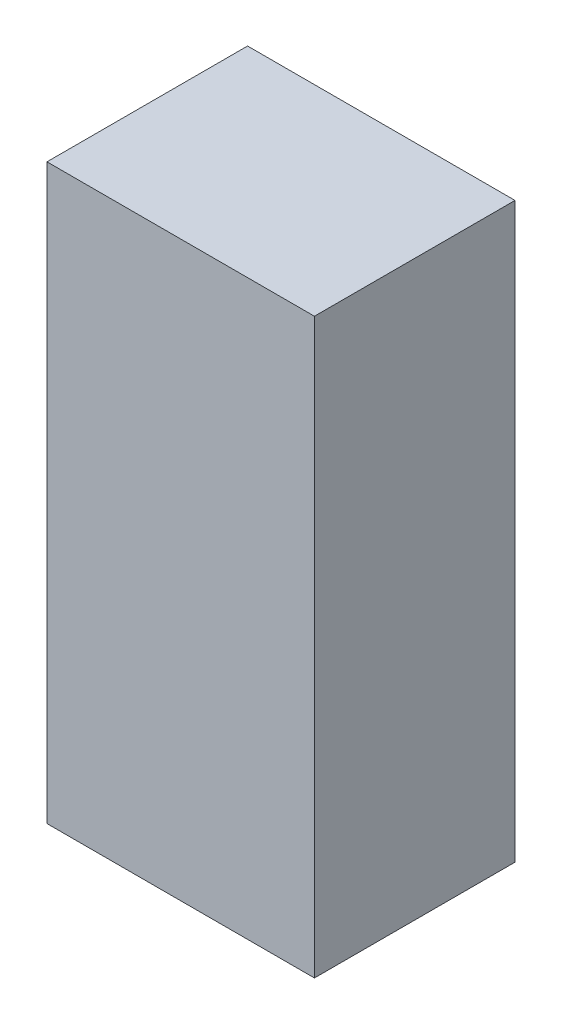
ISO-10303-21;
HEADER;
FILE_DESCRIPTION(('STEP AP214'),'2;1');
FILE_NAME('part.step','',(''),(''),'','','');
FILE_SCHEMA(('AUTOMOTIVE_DESIGN { 1 0 10303 214 1 1 1 1 }'));
ENDSEC;
DATA;
#1=APPLICATION_CONTEXT('core data for automotive mechanical design processes');
#2=APPLICATION_PROTOCOL_DEFINITION('international standard','automotive_design',2000,#1);
#3=PRODUCT_CONTEXT('',#1,'mechanical');
#4=PRODUCT('Part','Part','',(#3));
#5=PRODUCT_RELATED_PRODUCT_CATEGORY('part','',(#4));
#6=PRODUCT_DEFINITION_FORMATION('','',#4);
#7=PRODUCT_DEFINITION_CONTEXT('part definition',#1,'design');
#8=PRODUCT_DEFINITION('design','',#6,#7);
#9=PRODUCT_DEFINITION_SHAPE('','',#8);
#10=(LENGTH_UNIT() NAMED_UNIT(*) SI_UNIT(.MILLI.,.METRE.));
#11=(NAMED_UNIT(*) PLANE_ANGLE_UNIT() SI_UNIT($,.RADIAN.));
#12=(NAMED_UNIT(*) SI_UNIT($,.STERADIAN.) SOLID_ANGLE_UNIT());
#13=UNCERTAINTY_MEASURE_WITH_UNIT(LENGTH_MEASURE(1.E-05),#10,'distance_accuracy_value','');
#14=(GEOMETRIC_REPRESENTATION_CONTEXT(3) GLOBAL_UNCERTAINTY_ASSIGNED_CONTEXT((#13)) GLOBAL_UNIT_ASSIGNED_CONTEXT((#10,
#11,#12)) REPRESENTATION_CONTEXT('',''));
#15=CARTESIAN_POINT('',(0.,0.,0.));
#16=DIRECTION('',(0.,0.,1.));
#17=DIRECTION('',(1.,0.,0.));
#18=AXIS2_PLACEMENT_3D('',#15,#16,#17);
#19=CARTESIAN_POINT('',(-0.6999986,1.49999954,1.05000044));
#20=DIRECTION('',(0.,0.,-1.));
#21=DIRECTION('',(-1.,0.,0.));
#22=AXIS2_PLACEMENT_3D('',#19,#20,#21);
#23=PLANE('',#22);
#24=DIRECTION('',(1.,0.,0.));
#25=VECTOR('',#24,1.);
#26=CARTESIAN_POINT('',(-0.6999986,-1.49999954,1.05000044));
#27=LINE('',#26,#25);
#28=CARTESIAN_POINT('',(-0.6999986,-1.49999954,1.05000044));
#29=VERTEX_POINT('',#28);
#30=CARTESIAN_POINT('',(0.70000114,-1.49999954,1.05000044));
#31=VERTEX_POINT('',#30);
#32=EDGE_CURVE('E55',#29,#31,#27,.T.);
#33=ORIENTED_EDGE('',*,*,#32,.T.);
#34=DIRECTION('',(0.,1.,0.));
#35=VECTOR('',#34,1.);
#36=CARTESIAN_POINT('',(0.70000114,-1.49999954,1.05000044));
#37=LINE('',#36,#35);
#38=CARTESIAN_POINT('',(0.70000114,1.49999954,1.05000044));
#39=VERTEX_POINT('',#38);
#40=EDGE_CURVE('E57',#31,#39,#37,.T.);
#41=ORIENTED_EDGE('',*,*,#40,.T.);
#42=DIRECTION('',(1.,0.,0.));
#43=VECTOR('',#42,1.);
#44=CARTESIAN_POINT('',(0.70000114,1.49999954,1.05000044));
#45=LINE('',#44,#43);
#46=CARTESIAN_POINT('',(-0.6999986,1.49999954,1.05000044));
#47=VERTEX_POINT('',#46);
#48=EDGE_CURVE('E20',#39,#47,#45,.F.);
#49=ORIENTED_EDGE('',*,*,#48,.T.);
#50=DIRECTION('',(0.,1.,0.));
#51=VECTOR('',#50,1.);
#52=CARTESIAN_POINT('',(-0.6999986,1.49999954,1.05000044));
#53=LINE('',#52,#51);
#54=EDGE_CURVE('E80',#47,#29,#53,.F.);
#55=ORIENTED_EDGE('',*,*,#54,.T.);
#56=EDGE_LOOP('',(#33,#41,#49,#55));
#57=FACE_BOUND('',#56,.T.);
#58=ADVANCED_FACE('F17',(#57),#23,.F.);
#59=CARTESIAN_POINT('',(0.70000114,1.49999954,0.));
#60=DIRECTION('',(0.,-1.,0.));
#61=DIRECTION('',(0.,0.,-1.));
#62=AXIS2_PLACEMENT_3D('',#59,#60,#61);
#63=PLANE('',#62);
#64=DIRECTION('',(0.,0.,-1.));
#65=VECTOR('',#64,1.);
#66=CARTESIAN_POINT('',(-0.6999986,1.49999954,0.));
#67=LINE('',#66,#65);
#68=CARTESIAN_POINT('',(-0.6999986,1.49999954,0.));
#69=VERTEX_POINT('',#68);
#70=EDGE_CURVE('E68',#69,#47,#67,.F.);
#71=ORIENTED_EDGE('',*,*,#70,.T.);
#72=ORIENTED_EDGE('',*,*,#48,.F.);
#73=DIRECTION('',(0.,0.,1.));
#74=VECTOR('',#73,1.);
#75=CARTESIAN_POINT('',(0.70000114,1.49999954,0.));
#76=LINE('',#75,#74);
#77=CARTESIAN_POINT('',(0.70000114,1.49999954,0.));
#78=VERTEX_POINT('',#77);
#79=EDGE_CURVE('E63',#39,#78,#76,.F.);
#80=ORIENTED_EDGE('',*,*,#79,.T.);
#81=DIRECTION('',(-1.,0.,0.));
#82=VECTOR('',#81,1.);
#83=CARTESIAN_POINT('',(-0.6999986,1.49999954,0.));
#84=LINE('',#83,#82);
#85=EDGE_CURVE('E83',#69,#78,#84,.F.);
#86=ORIENTED_EDGE('',*,*,#85,.F.);
#87=EDGE_LOOP('',(#71,#72,#80,#86));
#88=FACE_BOUND('',#87,.T.);
#89=ADVANCED_FACE('F65',(#88),#63,.F.);
#90=CARTESIAN_POINT('',(0.70000114,-1.49999954,0.));
#91=DIRECTION('',(-1.,0.,0.));
#92=DIRECTION('',(0.,0.,1.));
#93=AXIS2_PLACEMENT_3D('',#90,#91,#92);
#94=PLANE('',#93);
#95=ORIENTED_EDGE('',*,*,#79,.F.);
#96=ORIENTED_EDGE('',*,*,#40,.F.);
#97=DIRECTION('',(0.,0.,1.));
#98=VECTOR('',#97,1.);
#99=CARTESIAN_POINT('',(0.70000114,-1.49999954,0.));
#100=LINE('',#99,#98);
#101=CARTESIAN_POINT('',(0.70000114,-1.49999954,0.));
#102=VERTEX_POINT('',#101);
#103=EDGE_CURVE('E75',#31,#102,#100,.F.);
#104=ORIENTED_EDGE('',*,*,#103,.T.);
#105=DIRECTION('',(0.,1.,0.));
#106=VECTOR('',#105,1.);
#107=CARTESIAN_POINT('',(0.70000114,1.49999954,0.));
#108=LINE('',#107,#106);
#109=EDGE_CURVE('E72',#78,#102,#108,.F.);
#110=ORIENTED_EDGE('',*,*,#109,.F.);
#111=EDGE_LOOP('',(#95,#96,#104,#110));
#112=FACE_BOUND('',#111,.T.);
#113=ADVANCED_FACE('F70',(#112),#94,.F.);
#114=CARTESIAN_POINT('',(-0.6999986,-1.49999954,0.));
#115=DIRECTION('',(0.,1.,0.));
#116=DIRECTION('',(0.,0.,1.));
#117=AXIS2_PLACEMENT_3D('',#114,#115,#116);
#118=PLANE('',#117);
#119=ORIENTED_EDGE('',*,*,#103,.F.);
#120=ORIENTED_EDGE('',*,*,#32,.F.);
#121=DIRECTION('',(0.,0.,-1.));
#122=VECTOR('',#121,1.);
#123=CARTESIAN_POINT('',(-0.6999986,-1.49999954,0.));
#124=LINE('',#123,#122);
#125=CARTESIAN_POINT('',(-0.6999986,-1.49999954,0.));
#126=VERTEX_POINT('',#125);
#127=EDGE_CURVE('E35',#29,#126,#124,.T.);
#128=ORIENTED_EDGE('',*,*,#127,.T.);
#129=DIRECTION('',(-1.,0.,0.));
#130=VECTOR('',#129,1.);
#131=CARTESIAN_POINT('',(-0.6999986,-1.49999954,0.));
#132=LINE('',#131,#130);
#133=EDGE_CURVE('E26',#102,#126,#132,.T.);
#134=ORIENTED_EDGE('',*,*,#133,.F.);
#135=EDGE_LOOP('',(#119,#120,#128,#134));
#136=FACE_BOUND('',#135,.T.);
#137=ADVANCED_FACE('F89',(#136),#118,.F.);
#138=CARTESIAN_POINT('',(-0.6999986,1.49999954,0.));
#139=DIRECTION('',(1.,0.,0.));
#140=DIRECTION('',(0.,0.,-1.));
#141=AXIS2_PLACEMENT_3D('',#138,#139,#140);
#142=PLANE('',#141);
#143=ORIENTED_EDGE('',*,*,#127,.F.);
#144=ORIENTED_EDGE('',*,*,#54,.F.);
#145=ORIENTED_EDGE('',*,*,#70,.F.);
#146=DIRECTION('',(0.,1.,0.));
#147=VECTOR('',#146,1.);
#148=CARTESIAN_POINT('',(-0.6999986,1.49999954,0.));
#149=LINE('',#148,#147);
#150=EDGE_CURVE('E11',#126,#69,#149,.T.);
#151=ORIENTED_EDGE('',*,*,#150,.F.);
#152=EDGE_LOOP('',(#143,#144,#145,#151));
#153=FACE_BOUND('',#152,.T.);
#154=ADVANCED_FACE('F91',(#153),#142,.F.);
#155=CARTESIAN_POINT('',(-0.6999986,1.49999954,0.));
#156=DIRECTION('',(0.,0.,-1.));
#157=DIRECTION('',(-1.,0.,0.));
#158=AXIS2_PLACEMENT_3D('',#155,#156,#157);
#159=PLANE('',#158);
#160=ORIENTED_EDGE('',*,*,#133,.T.);
#161=ORIENTED_EDGE('',*,*,#150,.T.);
#162=ORIENTED_EDGE('',*,*,#85,.T.);
#163=ORIENTED_EDGE('',*,*,#109,.T.);
#164=EDGE_LOOP('',(#160,#161,#162,#163));
#165=FACE_BOUND('',#164,.T.);
#166=ADVANCED_FACE('F88',(#165),#159,.T.);
#167=CLOSED_SHELL('',(#58,#89,#113,#137,#154,#166));
#168=MANIFOLD_SOLID_BREP('B1',#167);
#169=ADVANCED_BREP_SHAPE_REPRESENTATION('',(#18,#168),#14);
#170=SHAPE_DEFINITION_REPRESENTATION(#9,#169);
ENDSEC;
END-ISO-10303-21;
